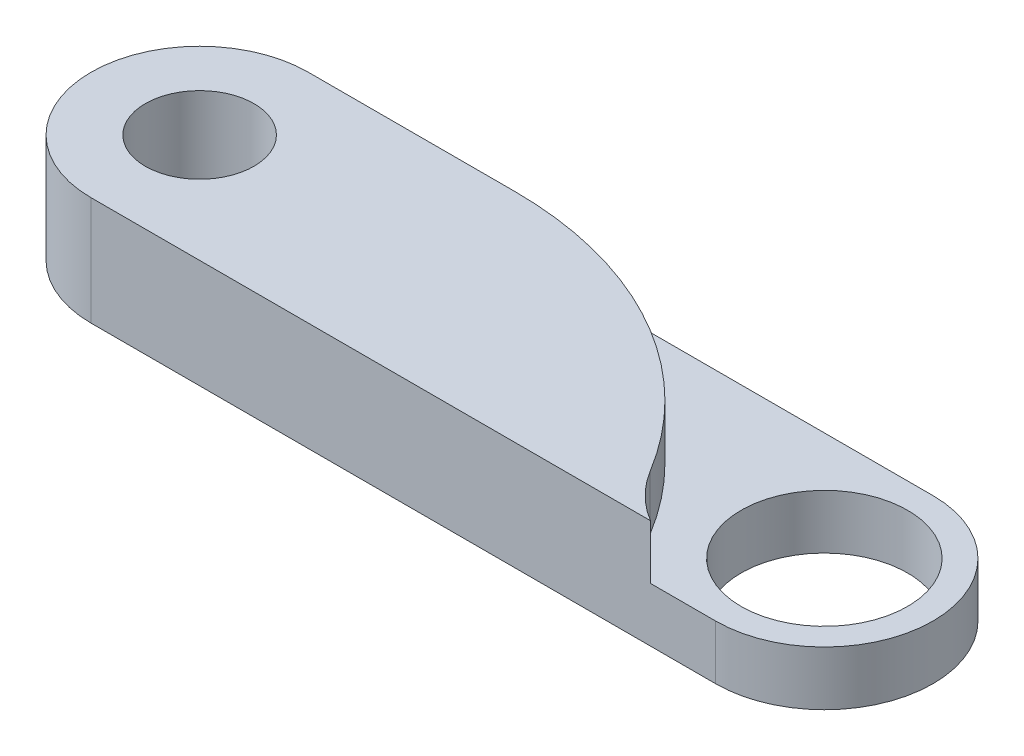
ISO-10303-21;
HEADER;
FILE_DESCRIPTION(('STEP AP214'),'2;1');
FILE_NAME('part.step','',(''),(''),'','','');
FILE_SCHEMA(('AUTOMOTIVE_DESIGN { 1 0 10303 214 1 1 1 1 }'));
ENDSEC;
DATA;
#1=APPLICATION_CONTEXT('core data for automotive mechanical design processes');
#2=APPLICATION_PROTOCOL_DEFINITION('international standard','automotive_design',2000,#1);
#3=PRODUCT_CONTEXT('',#1,'mechanical');
#4=PRODUCT('Part','Part','',(#3));
#5=PRODUCT_RELATED_PRODUCT_CATEGORY('part','',(#4));
#6=PRODUCT_DEFINITION_FORMATION('','',#4);
#7=PRODUCT_DEFINITION_CONTEXT('part definition',#1,'design');
#8=PRODUCT_DEFINITION('design','',#6,#7);
#9=PRODUCT_DEFINITION_SHAPE('','',#8);
#10=(LENGTH_UNIT() NAMED_UNIT(*) SI_UNIT(.MILLI.,.METRE.));
#11=(NAMED_UNIT(*) PLANE_ANGLE_UNIT() SI_UNIT($,.RADIAN.));
#12=(NAMED_UNIT(*) SI_UNIT($,.STERADIAN.) SOLID_ANGLE_UNIT());
#13=UNCERTAINTY_MEASURE_WITH_UNIT(LENGTH_MEASURE(1.E-05),#10,'distance_accuracy_value','');
#14=(GEOMETRIC_REPRESENTATION_CONTEXT(3) GLOBAL_UNCERTAINTY_ASSIGNED_CONTEXT((#13)) GLOBAL_UNIT_ASSIGNED_CONTEXT((#10,
#11,#12)) REPRESENTATION_CONTEXT('',''));
#15=CARTESIAN_POINT('',(0.,0.,0.));
#16=DIRECTION('',(0.,0.,1.));
#17=DIRECTION('',(1.,0.,0.));
#18=AXIS2_PLACEMENT_3D('',#15,#16,#17);
#19=CARTESIAN_POINT('',(17.25,6.,0.));
#20=DIRECTION('',(0.,-1.,0.));
#21=DIRECTION('',(0.,0.,-1.));
#22=AXIS2_PLACEMENT_3D('',#19,#20,#21);
#23=CYLINDRICAL_SURFACE('',#22,6.00000000000001);
#24=CARTESIAN_POINT('',(17.25,3.,0.));
#25=DIRECTION('',(0.,1.,0.));
#26=DIRECTION('',(0.,0.,1.));
#27=AXIS2_PLACEMENT_3D('',#24,#25,#26);
#28=CIRCLE('',#27,6.00000000000001);
#29=CARTESIAN_POINT('',(17.25,3.,6.));
#30=VERTEX_POINT('',#29);
#31=CARTESIAN_POINT('',(17.25,3.,-6.00000000000001));
#32=VERTEX_POINT('',#31);
#33=EDGE_CURVE('E188',#30,#32,#28,.T.);
#34=ORIENTED_EDGE('',*,*,#33,.F.);
#35=DIRECTION('',(0.,-1.,0.));
#36=VECTOR('',#35,1.);
#37=CARTESIAN_POINT('',(17.25,6.,6.));
#38=LINE('',#37,#36);
#39=CARTESIAN_POINT('',(17.25,0.,6.));
#40=VERTEX_POINT('',#39);
#41=EDGE_CURVE('E136',#30,#40,#38,.T.);
#42=ORIENTED_EDGE('',*,*,#41,.T.);
#43=CARTESIAN_POINT('',(17.25,0.,0.));
#44=DIRECTION('',(0.,1.,0.));
#45=DIRECTION('',(0.,0.,1.));
#46=AXIS2_PLACEMENT_3D('',#43,#44,#45);
#47=CIRCLE('',#46,6.00000000000001);
#48=CARTESIAN_POINT('',(17.25,0.,-6.00000000000001));
#49=VERTEX_POINT('',#48);
#50=EDGE_CURVE('E128',#40,#49,#47,.T.);
#51=ORIENTED_EDGE('',*,*,#50,.T.);
#52=DIRECTION('',(0.,-1.,0.));
#53=VECTOR('',#52,1.);
#54=CARTESIAN_POINT('',(17.25,6.,-6.00000000000001));
#55=LINE('',#54,#53);
#56=EDGE_CURVE('E134',#32,#49,#55,.T.);
#57=ORIENTED_EDGE('',*,*,#56,.F.);
#58=EDGE_LOOP('',(#34,#42,#51,#57));
#59=FACE_BOUND('',#58,.T.);
#60=ADVANCED_FACE('F34',(#59),#23,.T.);
#61=CARTESIAN_POINT('',(17.25,6.,0.));
#62=DIRECTION('',(0.,-1.,0.));
#63=DIRECTION('',(0.,0.,-1.));
#64=AXIS2_PLACEMENT_3D('',#61,#62,#63);
#65=CYLINDRICAL_SURFACE('',#64,4.6);
#66=CARTESIAN_POINT('',(17.25,0.,0.));
#67=DIRECTION('',(0.,1.,0.));
#68=DIRECTION('',(0.,0.,1.));
#69=AXIS2_PLACEMENT_3D('',#66,#67,#68);
#70=CIRCLE('',#69,4.6);
#71=CARTESIAN_POINT('',(17.25,0.,4.59999999999999));
#72=VERTEX_POINT('',#71);
#73=EDGE_CURVE('E106',#72,#72,#70,.T.);
#74=ORIENTED_EDGE('',*,*,#73,.F.);
#75=EDGE_LOOP('',(#74));
#76=FACE_BOUND('',#75,.T.);
#77=CARTESIAN_POINT('',(17.25,3.,0.));
#78=DIRECTION('',(0.,1.,0.));
#79=DIRECTION('',(0.,0.,1.));
#80=AXIS2_PLACEMENT_3D('',#77,#78,#79);
#81=CIRCLE('',#80,4.6);
#82=CARTESIAN_POINT('',(17.25,3.,4.59999999999999));
#83=VERTEX_POINT('',#82);
#84=EDGE_CURVE('E141',#83,#83,#81,.T.);
#85=ORIENTED_EDGE('',*,*,#84,.T.);
#86=EDGE_LOOP('',(#85));
#87=FACE_BOUND('',#86,.T.);
#88=ADVANCED_FACE('F162',(#76,#87),#65,.F.);
#89=CARTESIAN_POINT('',(-17.25,6.,0.));
#90=DIRECTION('',(0.,1.,0.));
#91=DIRECTION('',(0.,0.,1.));
#92=AXIS2_PLACEMENT_3D('',#89,#90,#91);
#93=PLANE('',#92);
#94=CARTESIAN_POINT('',(17.25,6.,0.));
#95=DIRECTION('',(0.,1.,0.));
#96=DIRECTION('',(0.,0.,1.));
#97=AXIS2_PLACEMENT_3D('',#94,#95,#96);
#98=CIRCLE('',#97,7.);
#99=CARTESIAN_POINT('',(11.2645352100514,6.,3.62962962962962));
#100=VERTEX_POINT('',#99);
#101=CARTESIAN_POINT('',(13.644448724536,6.,6.));
#102=VERTEX_POINT('',#101);
#103=EDGE_CURVE('E89',#100,#102,#98,.T.);
#104=ORIENTED_EDGE('',*,*,#103,.F.);
#105=CARTESIAN_POINT('',(-5.83679276123039,6.,14.));
#106=DIRECTION('',(0.,1.,0.));
#107=DIRECTION('',(0.,0.,1.));
#108=AXIS2_PLACEMENT_3D('',#105,#106,#107);
#109=CIRCLE('',#108,20.);
#110=CARTESIAN_POINT('',(-5.8367927612304,6.,-6.00000000000001));
#111=VERTEX_POINT('',#110);
#112=EDGE_CURVE('E42',#100,#111,#109,.T.);
#113=ORIENTED_EDGE('',*,*,#112,.T.);
#114=DIRECTION('',(-1.,0.,0.));
#115=VECTOR('',#114,1.);
#116=CARTESIAN_POINT('',(-17.25,6.,-6.00000000000001));
#117=LINE('',#116,#115);
#118=CARTESIAN_POINT('',(-17.25,6.,-6.00000000000001));
#119=VERTEX_POINT('',#118);
#120=EDGE_CURVE('E113',#111,#119,#117,.T.);
#121=ORIENTED_EDGE('',*,*,#120,.T.);
#122=CARTESIAN_POINT('',(-17.25,6.,0.));
#123=DIRECTION('',(0.,1.,0.));
#124=DIRECTION('',(0.,0.,1.));
#125=AXIS2_PLACEMENT_3D('',#122,#123,#124);
#126=CIRCLE('',#125,6.00000000000001);
#127=CARTESIAN_POINT('',(-17.25,6.,6.00000000000001));
#128=VERTEX_POINT('',#127);
#129=EDGE_CURVE('E111',#119,#128,#126,.T.);
#130=ORIENTED_EDGE('',*,*,#129,.T.);
#131=DIRECTION('',(1.,0.,0.));
#132=VECTOR('',#131,1.);
#133=CARTESIAN_POINT('',(-17.25,6.,6.00000000000001));
#134=LINE('',#133,#132);
#135=EDGE_CURVE('E102',#128,#102,#134,.T.);
#136=ORIENTED_EDGE('',*,*,#135,.T.);
#137=EDGE_LOOP('',(#104,#113,#121,#130,#136));
#138=FACE_BOUND('',#137,.T.);
#139=CARTESIAN_POINT('',(-17.25,6.,0.));
#140=DIRECTION('',(0.,1.,0.));
#141=DIRECTION('',(0.,0.,1.));
#142=AXIS2_PLACEMENT_3D('',#139,#140,#141);
#143=CIRCLE('',#142,3.);
#144=CARTESIAN_POINT('',(-17.25,6.,3.));
#145=VERTEX_POINT('',#144);
#146=EDGE_CURVE('E125',#145,#145,#143,.T.);
#147=ORIENTED_EDGE('',*,*,#146,.F.);
#148=EDGE_LOOP('',(#147));
#149=FACE_BOUND('',#148,.T.);
#150=ADVANCED_FACE('F108',(#138,#149),#93,.T.);
#151=CARTESIAN_POINT('',(-17.25,0.,0.));
#152=DIRECTION('',(0.,1.,0.));
#153=DIRECTION('',(0.,0.,1.));
#154=AXIS2_PLACEMENT_3D('',#151,#152,#153);
#155=PLANE('',#154);
#156=CARTESIAN_POINT('',(-17.25,0.,0.));
#157=DIRECTION('',(0.,1.,0.));
#158=DIRECTION('',(0.,0.,1.));
#159=AXIS2_PLACEMENT_3D('',#156,#157,#158);
#160=CIRCLE('',#159,6.00000000000001);
#161=CARTESIAN_POINT('',(-17.25,0.,-6.00000000000001));
#162=VERTEX_POINT('',#161);
#163=CARTESIAN_POINT('',(-17.25,0.,6.00000000000001));
#164=VERTEX_POINT('',#163);
#165=EDGE_CURVE('E121',#162,#164,#160,.T.);
#166=ORIENTED_EDGE('',*,*,#165,.F.);
#167=DIRECTION('',(-1.,0.,0.));
#168=VECTOR('',#167,1.);
#169=CARTESIAN_POINT('',(-17.25,0.,-6.00000000000001));
#170=LINE('',#169,#168);
#171=EDGE_CURVE('E117',#49,#162,#170,.T.);
#172=ORIENTED_EDGE('',*,*,#171,.F.);
#173=ORIENTED_EDGE('',*,*,#50,.F.);
#174=DIRECTION('',(1.,0.,0.));
#175=VECTOR('',#174,1.);
#176=CARTESIAN_POINT('',(-17.25,0.,6.00000000000001));
#177=LINE('',#176,#175);
#178=EDGE_CURVE('E124',#164,#40,#177,.T.);
#179=ORIENTED_EDGE('',*,*,#178,.F.);
#180=EDGE_LOOP('',(#166,#172,#173,#179));
#181=FACE_BOUND('',#180,.T.);
#182=CARTESIAN_POINT('',(-17.25,0.,0.));
#183=DIRECTION('',(0.,1.,0.));
#184=DIRECTION('',(0.,0.,1.));
#185=AXIS2_PLACEMENT_3D('',#182,#183,#184);
#186=CIRCLE('',#185,3.);
#187=CARTESIAN_POINT('',(-17.25,0.,3.));
#188=VERTEX_POINT('',#187);
#189=EDGE_CURVE('E195',#188,#188,#186,.T.);
#190=ORIENTED_EDGE('',*,*,#189,.T.);
#191=EDGE_LOOP('',(#190));
#192=FACE_BOUND('',#191,.T.);
#193=ORIENTED_EDGE('',*,*,#73,.T.);
#194=EDGE_LOOP('',(#193));
#195=FACE_BOUND('',#194,.T.);
#196=ADVANCED_FACE('F177',(#181,#192,#195),#155,.F.);
#197=CARTESIAN_POINT('',(-17.25,6.,0.));
#198=DIRECTION('',(0.,-1.,0.));
#199=DIRECTION('',(0.,0.,-1.));
#200=AXIS2_PLACEMENT_3D('',#197,#198,#199);
#201=CYLINDRICAL_SURFACE('',#200,6.00000000000001);
#202=ORIENTED_EDGE('',*,*,#165,.T.);
#203=DIRECTION('',(0.,-1.,0.));
#204=VECTOR('',#203,1.);
#205=CARTESIAN_POINT('',(-17.25,6.,6.00000000000001));
#206=LINE('',#205,#204);
#207=EDGE_CURVE('E138',#128,#164,#206,.T.);
#208=ORIENTED_EDGE('',*,*,#207,.F.);
#209=ORIENTED_EDGE('',*,*,#129,.F.);
#210=DIRECTION('',(0.,-1.,0.));
#211=VECTOR('',#210,1.);
#212=CARTESIAN_POINT('',(-17.25,6.,-6.00000000000001));
#213=LINE('',#212,#211);
#214=EDGE_CURVE('E115',#119,#162,#213,.T.);
#215=ORIENTED_EDGE('',*,*,#214,.T.);
#216=EDGE_LOOP('',(#202,#208,#209,#215));
#217=FACE_BOUND('',#216,.T.);
#218=ADVANCED_FACE('F175',(#217),#201,.T.);
#219=CARTESIAN_POINT('',(-17.25,6.,6.00000000000001));
#220=DIRECTION('',(0.,0.,-1.));
#221=DIRECTION('',(-1.,0.,0.));
#222=AXIS2_PLACEMENT_3D('',#219,#220,#221);
#223=PLANE('',#222);
#224=DIRECTION('',(1.,0.,0.));
#225=VECTOR('',#224,1.);
#226=CARTESIAN_POINT('',(-17.25,3.,6.00000000000001));
#227=LINE('',#226,#225);
#228=CARTESIAN_POINT('',(13.644448724536,3.,6.));
#229=VERTEX_POINT('',#228);
#230=EDGE_CURVE('E105',#229,#30,#227,.T.);
#231=ORIENTED_EDGE('',*,*,#230,.F.);
#232=DIRECTION('',(0.,1.,0.));
#233=VECTOR('',#232,1.);
#234=CARTESIAN_POINT('',(13.644448724536,3.,6.));
#235=LINE('',#234,#233);
#236=EDGE_CURVE('E92',#229,#102,#235,.T.);
#237=ORIENTED_EDGE('',*,*,#236,.T.);
#238=ORIENTED_EDGE('',*,*,#135,.F.);
#239=ORIENTED_EDGE('',*,*,#207,.T.);
#240=ORIENTED_EDGE('',*,*,#178,.T.);
#241=ORIENTED_EDGE('',*,*,#41,.F.);
#242=EDGE_LOOP('',(#231,#237,#238,#239,#240,#241));
#243=FACE_BOUND('',#242,.T.);
#244=ADVANCED_FACE('F100',(#243),#223,.F.);
#245=CARTESIAN_POINT('',(-17.25,6.,-6.00000000000001));
#246=DIRECTION('',(0.,0.,1.));
#247=DIRECTION('',(1.,0.,0.));
#248=AXIS2_PLACEMENT_3D('',#245,#246,#247);
#249=PLANE('',#248);
#250=ORIENTED_EDGE('',*,*,#120,.F.);
#251=DIRECTION('',(0.,1.,0.));
#252=VECTOR('',#251,1.);
#253=CARTESIAN_POINT('',(-5.8367927612304,6.,-6.00000000000001));
#254=LINE('',#253,#252);
#255=CARTESIAN_POINT('',(-5.8367927612304,3.,-6.00000000000001));
#256=VERTEX_POINT('',#255);
#257=EDGE_CURVE('E140',#111,#256,#254,.F.);
#258=ORIENTED_EDGE('',*,*,#257,.T.);
#259=DIRECTION('',(-1.,0.,0.));
#260=VECTOR('',#259,1.);
#261=CARTESIAN_POINT('',(-17.25,3.,-6.00000000000001));
#262=LINE('',#261,#260);
#263=EDGE_CURVE('E144',#32,#256,#262,.T.);
#264=ORIENTED_EDGE('',*,*,#263,.F.);
#265=ORIENTED_EDGE('',*,*,#56,.T.);
#266=ORIENTED_EDGE('',*,*,#171,.T.);
#267=ORIENTED_EDGE('',*,*,#214,.F.);
#268=EDGE_LOOP('',(#250,#258,#264,#265,#266,#267));
#269=FACE_BOUND('',#268,.T.);
#270=ADVANCED_FACE('F152',(#269),#249,.F.);
#271=CARTESIAN_POINT('',(-17.25,6.,0.));
#272=DIRECTION('',(0.,-1.,0.));
#273=DIRECTION('',(0.,0.,-1.));
#274=AXIS2_PLACEMENT_3D('',#271,#272,#273);
#275=CYLINDRICAL_SURFACE('',#274,3.);
#276=ORIENTED_EDGE('',*,*,#146,.T.);
#277=EDGE_LOOP('',(#276));
#278=FACE_BOUND('',#277,.T.);
#279=ORIENTED_EDGE('',*,*,#189,.F.);
#280=EDGE_LOOP('',(#279));
#281=FACE_BOUND('',#280,.T.);
#282=ADVANCED_FACE('F201',(#278,#281),#275,.F.);
#283=CARTESIAN_POINT('',(17.25,3.,0.));
#284=DIRECTION('',(0.,1.,0.));
#285=DIRECTION('',(0.,0.,1.));
#286=AXIS2_PLACEMENT_3D('',#283,#284,#285);
#287=CYLINDRICAL_SURFACE('',#286,7.);
#288=CARTESIAN_POINT('',(17.25,3.,0.));
#289=DIRECTION('',(0.,1.,0.));
#290=DIRECTION('',(0.,0.,1.));
#291=AXIS2_PLACEMENT_3D('',#288,#289,#290);
#292=CIRCLE('',#291,7.);
#293=CARTESIAN_POINT('',(11.2645352100514,3.,3.62962962962962));
#294=VERTEX_POINT('',#293);
#295=EDGE_CURVE('E97',#294,#229,#292,.T.);
#296=ORIENTED_EDGE('',*,*,#295,.F.);
#297=DIRECTION('',(0.,1.,0.));
#298=VECTOR('',#297,1.);
#299=CARTESIAN_POINT('',(11.2645352100514,3.,3.62962962962963));
#300=LINE('',#299,#298);
#301=EDGE_CURVE('E49',#294,#100,#300,.T.);
#302=ORIENTED_EDGE('',*,*,#301,.T.);
#303=ORIENTED_EDGE('',*,*,#103,.T.);
#304=ORIENTED_EDGE('',*,*,#236,.F.);
#305=EDGE_LOOP('',(#296,#302,#303,#304));
#306=FACE_BOUND('',#305,.T.);
#307=ADVANCED_FACE('F91',(#306),#287,.F.);
#308=CARTESIAN_POINT('',(17.25,3.,0.));
#309=DIRECTION('',(0.,1.,0.));
#310=DIRECTION('',(0.,0.,1.));
#311=AXIS2_PLACEMENT_3D('',#308,#309,#310);
#312=PLANE('',#311);
#313=ORIENTED_EDGE('',*,*,#84,.F.);
#314=EDGE_LOOP('',(#313));
#315=FACE_BOUND('',#314,.T.);
#316=ORIENTED_EDGE('',*,*,#230,.T.);
#317=ORIENTED_EDGE('',*,*,#33,.T.);
#318=ORIENTED_EDGE('',*,*,#263,.T.);
#319=CARTESIAN_POINT('',(-5.83679276123039,3.,14.));
#320=DIRECTION('',(0.,1.,0.));
#321=DIRECTION('',(0.,0.,1.));
#322=AXIS2_PLACEMENT_3D('',#319,#320,#321);
#323=CIRCLE('',#322,20.);
#324=EDGE_CURVE('E11',#256,#294,#323,.F.);
#325=ORIENTED_EDGE('',*,*,#324,.T.);
#326=ORIENTED_EDGE('',*,*,#295,.T.);
#327=EDGE_LOOP('',(#316,#317,#318,#325,#326));
#328=FACE_BOUND('',#327,.T.);
#329=ADVANCED_FACE('F155',(#315,#328),#312,.T.);
#330=CARTESIAN_POINT('',(-5.83679276123039,3.,14.));
#331=DIRECTION('',(0.,1.,0.));
#332=DIRECTION('',(0.,0.,1.));
#333=AXIS2_PLACEMENT_3D('',#330,#331,#332);
#334=CYLINDRICAL_SURFACE('',#333,20.);
#335=ORIENTED_EDGE('',*,*,#112,.F.);
#336=ORIENTED_EDGE('',*,*,#301,.F.);
#337=ORIENTED_EDGE('',*,*,#324,.F.);
#338=ORIENTED_EDGE('',*,*,#257,.F.);
#339=EDGE_LOOP('',(#335,#336,#337,#338));
#340=FACE_BOUND('',#339,.T.);
#341=ADVANCED_FACE('F36',(#340),#334,.T.);
#342=CLOSED_SHELL('',(#60,#88,#150,#196,#218,#244,#270,#282,#307,#329,#341));
#343=MANIFOLD_SOLID_BREP('B2',#342);
#344=ADVANCED_BREP_SHAPE_REPRESENTATION('',(#18,#343),#14);
#345=SHAPE_DEFINITION_REPRESENTATION(#9,#344);
ENDSEC;
END-ISO-10303-21;
